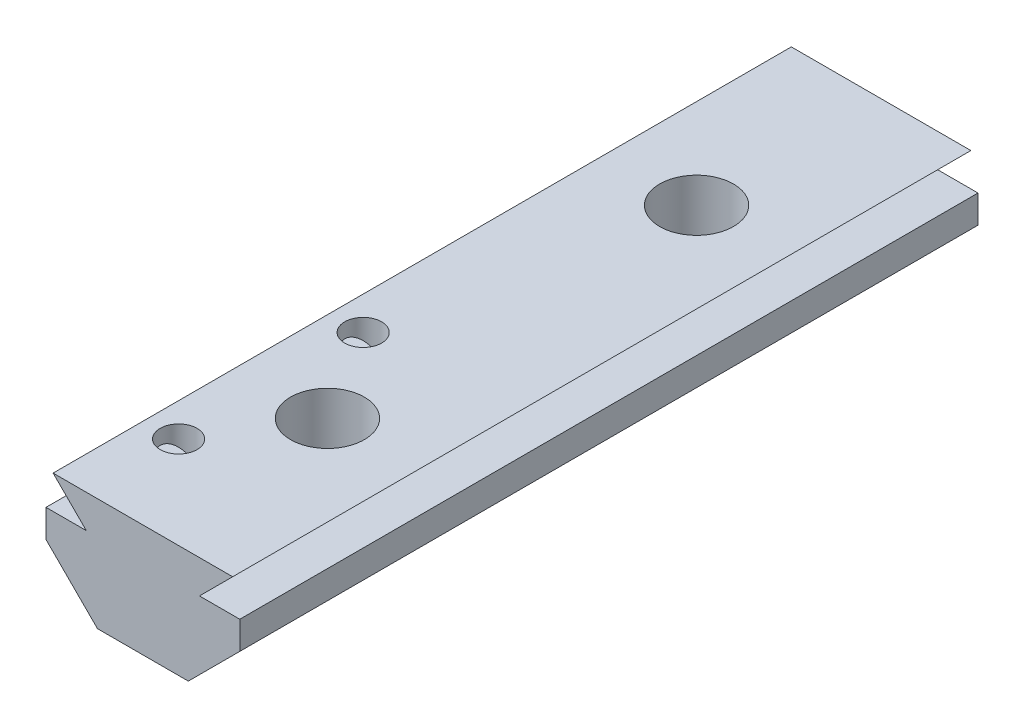
ISO-10303-21;
HEADER;
FILE_DESCRIPTION(('STEP AP214'),'2;1');
FILE_NAME('part.step','',(''),(''),'','','');
FILE_SCHEMA(('AUTOMOTIVE_DESIGN { 1 0 10303 214 1 1 1 1 }'));
ENDSEC;
DATA;
#1=APPLICATION_CONTEXT('core data for automotive mechanical design processes');
#2=APPLICATION_PROTOCOL_DEFINITION('international standard','automotive_design',2000,#1);
#3=PRODUCT_CONTEXT('',#1,'mechanical');
#4=PRODUCT('Part','Part','',(#3));
#5=PRODUCT_RELATED_PRODUCT_CATEGORY('part','',(#4));
#6=PRODUCT_DEFINITION_FORMATION('','',#4);
#7=PRODUCT_DEFINITION_CONTEXT('part definition',#1,'design');
#8=PRODUCT_DEFINITION('design','',#6,#7);
#9=PRODUCT_DEFINITION_SHAPE('','',#8);
#10=(LENGTH_UNIT() NAMED_UNIT(*) SI_UNIT(.MILLI.,.METRE.));
#11=(NAMED_UNIT(*) PLANE_ANGLE_UNIT() SI_UNIT($,.RADIAN.));
#12=(NAMED_UNIT(*) SI_UNIT($,.STERADIAN.) SOLID_ANGLE_UNIT());
#13=UNCERTAINTY_MEASURE_WITH_UNIT(LENGTH_MEASURE(1.E-05),#10,'distance_accuracy_value','');
#14=(GEOMETRIC_REPRESENTATION_CONTEXT(3) GLOBAL_UNCERTAINTY_ASSIGNED_CONTEXT((#13)) GLOBAL_UNIT_ASSIGNED_CONTEXT((#10,
#11,#12)) REPRESENTATION_CONTEXT('',''));
#15=CARTESIAN_POINT('',(0.,0.,0.));
#16=DIRECTION('',(0.,0.,1.));
#17=DIRECTION('',(1.,0.,0.));
#18=AXIS2_PLACEMENT_3D('',#15,#16,#17);
#19=CARTESIAN_POINT('',(2.46065352773283,0.,40.));
#20=DIRECTION('',(-0.707106781186543,0.707106781186552,0.));
#21=DIRECTION('',(-0.707106781186552,-0.707106781186543,0.));
#22=AXIS2_PLACEMENT_3D('',#19,#20,#21);
#23=PLANE('',#22);
#24=DIRECTION('',(0.707106781186552,0.707106781186543,0.));
#25=VECTOR('',#24,1.);
#26=CARTESIAN_POINT('',(2.46065352773283,0.,0.));
#27=LINE('',#26,#25);
#28=CARTESIAN_POINT('',(2.46065352773283,0.,0.));
#29=VERTEX_POINT('',#28);
#30=CARTESIAN_POINT('',(5.25,2.78934647226715,0.));
#31=VERTEX_POINT('',#30);
#32=EDGE_CURVE('E169',#29,#31,#27,.T.);
#33=ORIENTED_EDGE('',*,*,#32,.T.);
#34=DIRECTION('',(0.,0.,-1.));
#35=VECTOR('',#34,1.);
#36=CARTESIAN_POINT('',(5.25,2.78934647226715,40.));
#37=LINE('',#36,#35);
#38=CARTESIAN_POINT('',(5.25,2.78934647226715,40.));
#39=VERTEX_POINT('',#38);
#40=EDGE_CURVE('E127',#39,#31,#37,.T.);
#41=ORIENTED_EDGE('',*,*,#40,.F.);
#42=DIRECTION('',(0.707106781186552,0.707106781186543,0.));
#43=VECTOR('',#42,1.);
#44=CARTESIAN_POINT('',(2.46065352773283,0.,40.));
#45=LINE('',#44,#43);
#46=CARTESIAN_POINT('',(2.46065352773283,0.,40.));
#47=VERTEX_POINT('',#46);
#48=EDGE_CURVE('E200',#47,#39,#45,.T.);
#49=ORIENTED_EDGE('',*,*,#48,.F.);
#50=DIRECTION('',(0.,0.,-1.));
#51=VECTOR('',#50,1.);
#52=CARTESIAN_POINT('',(2.46065352773283,0.,40.));
#53=LINE('',#52,#51);
#54=EDGE_CURVE('E171',#47,#29,#53,.T.);
#55=ORIENTED_EDGE('',*,*,#54,.T.);
#56=EDGE_LOOP('',(#33,#41,#49,#55));
#57=FACE_BOUND('',#56,.T.);
#58=ADVANCED_FACE('F39',(#57),#23,.F.);
#59=CARTESIAN_POINT('',(5.25,2.78934647226715,40.));
#60=DIRECTION('',(-1.,0.,0.));
#61=DIRECTION('',(0.,0.,1.));
#62=AXIS2_PLACEMENT_3D('',#59,#60,#61);
#63=PLANE('',#62);
#64=DIRECTION('',(0.,1.,0.));
#65=VECTOR('',#64,1.);
#66=CARTESIAN_POINT('',(5.25,2.78934647226715,0.));
#67=LINE('',#66,#65);
#68=CARTESIAN_POINT('',(5.25,4.3,0.));
#69=VERTEX_POINT('',#68);
#70=EDGE_CURVE('E162',#31,#69,#67,.T.);
#71=ORIENTED_EDGE('',*,*,#70,.T.);
#72=DIRECTION('',(0.,0.,-1.));
#73=VECTOR('',#72,1.);
#74=CARTESIAN_POINT('',(5.25,4.3,40.));
#75=LINE('',#74,#73);
#76=CARTESIAN_POINT('',(5.25,4.3,40.));
#77=VERTEX_POINT('',#76);
#78=EDGE_CURVE('E153',#77,#69,#75,.T.);
#79=ORIENTED_EDGE('',*,*,#78,.F.);
#80=DIRECTION('',(0.,1.,0.));
#81=VECTOR('',#80,1.);
#82=CARTESIAN_POINT('',(5.25,2.78934647226715,40.));
#83=LINE('',#82,#81);
#84=EDGE_CURVE('E163',#39,#77,#83,.T.);
#85=ORIENTED_EDGE('',*,*,#84,.F.);
#86=ORIENTED_EDGE('',*,*,#40,.T.);
#87=EDGE_LOOP('',(#71,#79,#85,#86));
#88=FACE_BOUND('',#87,.T.);
#89=ADVANCED_FACE('F160',(#88),#63,.F.);
#90=CARTESIAN_POINT('',(5.25,4.3,40.));
#91=DIRECTION('',(0.,-1.,0.));
#92=DIRECTION('',(0.,0.,-1.));
#93=AXIS2_PLACEMENT_3D('',#90,#91,#92);
#94=PLANE('',#93);
#95=DIRECTION('',(-1.,0.,0.));
#96=VECTOR('',#95,1.);
#97=CARTESIAN_POINT('',(5.25,4.3,0.));
#98=LINE('',#97,#96);
#99=CARTESIAN_POINT('',(3.065,4.3,0.));
#100=VERTEX_POINT('',#99);
#101=EDGE_CURVE('E176',#69,#100,#98,.T.);
#102=ORIENTED_EDGE('',*,*,#101,.T.);
#103=DIRECTION('',(0.,0.,-1.));
#104=VECTOR('',#103,1.);
#105=CARTESIAN_POINT('',(3.065,4.3,40.));
#106=LINE('',#105,#104);
#107=CARTESIAN_POINT('',(3.065,4.3,40.));
#108=VERTEX_POINT('',#107);
#109=EDGE_CURVE('E150',#108,#100,#106,.T.);
#110=ORIENTED_EDGE('',*,*,#109,.F.);
#111=DIRECTION('',(-1.,0.,0.));
#112=VECTOR('',#111,1.);
#113=CARTESIAN_POINT('',(5.25,4.3,40.));
#114=LINE('',#113,#112);
#115=EDGE_CURVE('E238',#77,#108,#114,.T.);
#116=ORIENTED_EDGE('',*,*,#115,.F.);
#117=ORIENTED_EDGE('',*,*,#78,.T.);
#118=EDGE_LOOP('',(#102,#110,#116,#117));
#119=FACE_BOUND('',#118,.T.);
#120=ADVANCED_FACE('F290',(#119),#94,.F.);
#121=CARTESIAN_POINT('',(3.065,4.3,40.));
#122=DIRECTION('',(-0.707106781186545,0.70710678118655,0.));
#123=DIRECTION('',(-0.70710678118655,-0.707106781186545,0.));
#124=AXIS2_PLACEMENT_3D('',#121,#122,#123);
#125=PLANE('',#124);
#126=DIRECTION('',(0.70710678118655,0.707106781186545,0.));
#127=VECTOR('',#126,1.);
#128=CARTESIAN_POINT('',(3.065,4.3,0.));
#129=LINE('',#128,#127);
#130=CARTESIAN_POINT('',(4.86500000000002,6.1,0.));
#131=VERTEX_POINT('',#130);
#132=EDGE_CURVE('E186',#100,#131,#129,.T.);
#133=ORIENTED_EDGE('',*,*,#132,.T.);
#134=DIRECTION('',(0.,0.,-1.));
#135=VECTOR('',#134,1.);
#136=CARTESIAN_POINT('',(4.86500000000002,6.1,40.));
#137=LINE('',#136,#135);
#138=CARTESIAN_POINT('',(4.86500000000002,6.1,40.));
#139=VERTEX_POINT('',#138);
#140=EDGE_CURVE('E147',#139,#131,#137,.T.);
#141=ORIENTED_EDGE('',*,*,#140,.F.);
#142=DIRECTION('',(0.70710678118655,0.707106781186545,0.));
#143=VECTOR('',#142,1.);
#144=CARTESIAN_POINT('',(3.065,4.3,40.));
#145=LINE('',#144,#143);
#146=EDGE_CURVE('E236',#108,#139,#145,.T.);
#147=ORIENTED_EDGE('',*,*,#146,.F.);
#148=ORIENTED_EDGE('',*,*,#109,.T.);
#149=EDGE_LOOP('',(#133,#141,#147,#148));
#150=FACE_BOUND('',#149,.T.);
#151=ADVANCED_FACE('F268',(#150),#125,.F.);
#152=CARTESIAN_POINT('',(4.86500000000002,6.1,40.));
#153=DIRECTION('',(0.,-1.,0.));
#154=DIRECTION('',(1.,0.,0.));
#155=AXIS2_PLACEMENT_3D('',#152,#153,#154);
#156=PLANE('',#155);
#157=CARTESIAN_POINT('',(-3.065,6.1,35.));
#158=DIRECTION('',(0.,1.,0.));
#159=DIRECTION('',(-1.,0.,0.));
#160=AXIS2_PLACEMENT_3D('',#157,#158,#159);
#161=CIRCLE('',#160,1.);
#162=CARTESIAN_POINT('',(-4.065,6.1,35.));
#163=VERTEX_POINT('',#162);
#164=EDGE_CURVE('E254',#163,#163,#161,.T.);
#165=ORIENTED_EDGE('',*,*,#164,.F.);
#166=EDGE_LOOP('',(#165));
#167=FACE_BOUND('',#166,.T.);
#168=CARTESIAN_POINT('',(-3.065,6.1,25.));
#169=DIRECTION('',(0.,1.,0.));
#170=DIRECTION('',(-1.,0.,0.));
#171=AXIS2_PLACEMENT_3D('',#168,#169,#170);
#172=CIRCLE('',#171,1.);
#173=CARTESIAN_POINT('',(-4.065,6.1,25.));
#174=VERTEX_POINT('',#173);
#175=EDGE_CURVE('E255',#174,#174,#172,.T.);
#176=ORIENTED_EDGE('',*,*,#175,.F.);
#177=EDGE_LOOP('',(#176));
#178=FACE_BOUND('',#177,.T.);
#179=CARTESIAN_POINT('',(0.,6.1,30.));
#180=DIRECTION('',(0.,1.,0.));
#181=DIRECTION('',(-1.,0.,0.));
#182=AXIS2_PLACEMENT_3D('',#179,#180,#181);
#183=CIRCLE('',#182,2.);
#184=CARTESIAN_POINT('',(-2.,6.1,30.));
#185=VERTEX_POINT('',#184);
#186=EDGE_CURVE('E179',#185,#185,#183,.T.);
#187=ORIENTED_EDGE('',*,*,#186,.F.);
#188=EDGE_LOOP('',(#187));
#189=FACE_BOUND('',#188,.T.);
#190=CARTESIAN_POINT('',(0.,6.1,10.));
#191=DIRECTION('',(0.,1.,0.));
#192=DIRECTION('',(-1.,0.,0.));
#193=AXIS2_PLACEMENT_3D('',#190,#191,#192);
#194=CIRCLE('',#193,2.);
#195=CARTESIAN_POINT('',(-2.,6.1,10.));
#196=VERTEX_POINT('',#195);
#197=EDGE_CURVE('E242',#196,#196,#194,.T.);
#198=ORIENTED_EDGE('',*,*,#197,.F.);
#199=EDGE_LOOP('',(#198));
#200=FACE_BOUND('',#199,.T.);
#201=DIRECTION('',(-1.,0.,0.));
#202=VECTOR('',#201,1.);
#203=CARTESIAN_POINT('',(4.86500000000002,6.1,0.));
#204=LINE('',#203,#202);
#205=CARTESIAN_POINT('',(-4.86500000000002,6.1,0.));
#206=VERTEX_POINT('',#205);
#207=EDGE_CURVE('E188',#131,#206,#204,.T.);
#208=ORIENTED_EDGE('',*,*,#207,.T.);
#209=DIRECTION('',(0.,0.,-1.));
#210=VECTOR('',#209,1.);
#211=CARTESIAN_POINT('',(-4.86500000000002,6.1,40.));
#212=LINE('',#211,#210);
#213=CARTESIAN_POINT('',(-4.86500000000002,6.1,40.));
#214=VERTEX_POINT('',#213);
#215=EDGE_CURVE('E140',#214,#206,#212,.T.);
#216=ORIENTED_EDGE('',*,*,#215,.F.);
#217=DIRECTION('',(-1.,0.,0.));
#218=VECTOR('',#217,1.);
#219=CARTESIAN_POINT('',(4.86500000000002,6.1,40.));
#220=LINE('',#219,#218);
#221=EDGE_CURVE('E234',#139,#214,#220,.T.);
#222=ORIENTED_EDGE('',*,*,#221,.F.);
#223=ORIENTED_EDGE('',*,*,#140,.T.);
#224=EDGE_LOOP('',(#208,#216,#222,#223));
#225=FACE_BOUND('',#224,.T.);
#226=ADVANCED_FACE('F265',(#167,#178,#189,#200,#225),#156,.F.);
#227=CARTESIAN_POINT('',(-3.065,4.3,40.));
#228=DIRECTION('',(0.707106781186544,0.707106781186551,0.));
#229=DIRECTION('',(-0.707106781186551,0.707106781186544,0.));
#230=AXIS2_PLACEMENT_3D('',#227,#228,#229);
#231=PLANE('',#230);
#232=DIRECTION('',(0.,0.,-1.));
#233=VECTOR('',#232,1.);
#234=CARTESIAN_POINT('',(-3.065,4.3,40.));
#235=LINE('',#234,#233);
#236=CARTESIAN_POINT('',(-3.065,4.3,34.));
#237=VERTEX_POINT('',#236);
#238=CARTESIAN_POINT('',(-3.065,4.3,26.));
#239=VERTEX_POINT('',#238);
#240=EDGE_CURVE('E131',#237,#239,#235,.T.);
#241=ORIENTED_EDGE('',*,*,#240,.F.);
#242=CARTESIAN_POINT('',(-3.065,4.3,35.));
#243=DIRECTION('',(0.707106781186544,0.707106781186551,0.));
#244=DIRECTION('',(-0.707106781186551,0.707106781186544,0.));
#245=AXIS2_PLACEMENT_3D('',#242,#243,#244);
#246=ELLIPSE('',#245,1.41421356237309,1.);
#247=CARTESIAN_POINT('',(-3.065,4.3,36.));
#248=VERTEX_POINT('',#247);
#249=EDGE_CURVE('E59',#237,#248,#246,.T.);
#250=ORIENTED_EDGE('',*,*,#249,.T.);
#251=CARTESIAN_POINT('',(-3.065,4.3,40.));
#252=VERTEX_POINT('',#251);
#253=EDGE_CURVE('E138',#252,#248,#235,.T.);
#254=ORIENTED_EDGE('',*,*,#253,.F.);
#255=DIRECTION('',(0.707106781186551,-0.707106781186544,0.));
#256=VECTOR('',#255,1.);
#257=CARTESIAN_POINT('',(-3.065,4.3,40.));
#258=LINE('',#257,#256);
#259=EDGE_CURVE('E232',#214,#252,#258,.T.);
#260=ORIENTED_EDGE('',*,*,#259,.F.);
#261=ORIENTED_EDGE('',*,*,#215,.T.);
#262=DIRECTION('',(0.707106781186551,-0.707106781186544,0.));
#263=VECTOR('',#262,1.);
#264=CARTESIAN_POINT('',(-3.065,4.3,0.));
#265=LINE('',#264,#263);
#266=CARTESIAN_POINT('',(-3.065,4.3,0.));
#267=VERTEX_POINT('',#266);
#268=EDGE_CURVE('E190',#206,#267,#265,.T.);
#269=ORIENTED_EDGE('',*,*,#268,.T.);
#270=CARTESIAN_POINT('',(-3.065,4.3,24.));
#271=VERTEX_POINT('',#270);
#272=EDGE_CURVE('E133',#271,#267,#235,.T.);
#273=ORIENTED_EDGE('',*,*,#272,.F.);
#274=CARTESIAN_POINT('',(-3.065,4.3,25.));
#275=DIRECTION('',(0.707106781186544,0.707106781186551,0.));
#276=DIRECTION('',(-0.707106781186551,0.707106781186544,0.));
#277=AXIS2_PLACEMENT_3D('',#274,#275,#276);
#278=ELLIPSE('',#277,1.41421356237309,1.);
#279=EDGE_CURVE('E52',#271,#239,#278,.T.);
#280=ORIENTED_EDGE('',*,*,#279,.T.);
#281=EDGE_LOOP('',(#241,#250,#254,#260,#261,#269,#273,#280));
#282=FACE_BOUND('',#281,.T.);
#283=ADVANCED_FACE('F130',(#282),#231,.F.);
#284=CARTESIAN_POINT('',(-5.25,4.3,40.));
#285=DIRECTION('',(0.,-1.,0.));
#286=DIRECTION('',(1.,0.,0.));
#287=AXIS2_PLACEMENT_3D('',#284,#285,#286);
#288=PLANE('',#287);
#289=ORIENTED_EDGE('',*,*,#253,.T.);
#290=CARTESIAN_POINT('',(-3.065,4.3,35.));
#291=DIRECTION('',(0.,-1.,0.));
#292=DIRECTION('',(1.,0.,0.));
#293=AXIS2_PLACEMENT_3D('',#290,#291,#292);
#294=CIRCLE('',#293,1.);
#295=EDGE_CURVE('E12',#248,#237,#294,.T.);
#296=ORIENTED_EDGE('',*,*,#295,.T.);
#297=ORIENTED_EDGE('',*,*,#240,.T.);
#298=CARTESIAN_POINT('',(-3.065,4.3,25.));
#299=DIRECTION('',(0.,-1.,0.));
#300=DIRECTION('',(1.,0.,0.));
#301=AXIS2_PLACEMENT_3D('',#298,#299,#300);
#302=CIRCLE('',#301,1.);
#303=EDGE_CURVE('E46',#239,#271,#302,.T.);
#304=ORIENTED_EDGE('',*,*,#303,.T.);
#305=ORIENTED_EDGE('',*,*,#272,.T.);
#306=DIRECTION('',(-1.,0.,0.));
#307=VECTOR('',#306,1.);
#308=CARTESIAN_POINT('',(-5.25,4.3,0.));
#309=LINE('',#308,#307);
#310=CARTESIAN_POINT('',(-5.25,4.3,0.));
#311=VERTEX_POINT('',#310);
#312=EDGE_CURVE('E192',#267,#311,#309,.T.);
#313=ORIENTED_EDGE('',*,*,#312,.T.);
#314=DIRECTION('',(0.,0.,-1.));
#315=VECTOR('',#314,1.);
#316=CARTESIAN_POINT('',(-5.25,4.3,40.));
#317=LINE('',#316,#315);
#318=CARTESIAN_POINT('',(-5.25,4.3,40.));
#319=VERTEX_POINT('',#318);
#320=EDGE_CURVE('E141',#319,#311,#317,.T.);
#321=ORIENTED_EDGE('',*,*,#320,.F.);
#322=DIRECTION('',(-1.,0.,0.));
#323=VECTOR('',#322,1.);
#324=CARTESIAN_POINT('',(-5.25,4.3,40.));
#325=LINE('',#324,#323);
#326=EDGE_CURVE('E228',#252,#319,#325,.T.);
#327=ORIENTED_EDGE('',*,*,#326,.F.);
#328=EDGE_LOOP('',(#289,#296,#297,#304,#305,#313,#321,#327));
#329=FACE_BOUND('',#328,.T.);
#330=ADVANCED_FACE('F137',(#329),#288,.F.);
#331=CARTESIAN_POINT('',(-5.25,2.78934647226715,40.));
#332=DIRECTION('',(1.,0.,0.));
#333=DIRECTION('',(0.,1.,0.));
#334=AXIS2_PLACEMENT_3D('',#331,#332,#333);
#335=PLANE('',#334);
#336=DIRECTION('',(0.,-1.,0.));
#337=VECTOR('',#336,1.);
#338=CARTESIAN_POINT('',(-5.25,2.78934647226715,0.));
#339=LINE('',#338,#337);
#340=CARTESIAN_POINT('',(-5.25,2.78934647226715,0.));
#341=VERTEX_POINT('',#340);
#342=EDGE_CURVE('E194',#311,#341,#339,.T.);
#343=ORIENTED_EDGE('',*,*,#342,.T.);
#344=DIRECTION('',(0.,0.,-1.));
#345=VECTOR('',#344,1.);
#346=CARTESIAN_POINT('',(-5.25,2.78934647226715,40.));
#347=LINE('',#346,#345);
#348=CARTESIAN_POINT('',(-5.25,2.78934647226715,40.));
#349=VERTEX_POINT('',#348);
#350=EDGE_CURVE('E204',#349,#341,#347,.T.);
#351=ORIENTED_EDGE('',*,*,#350,.F.);
#352=DIRECTION('',(0.,-1.,0.));
#353=VECTOR('',#352,1.);
#354=CARTESIAN_POINT('',(-5.25,2.78934647226715,40.));
#355=LINE('',#354,#353);
#356=EDGE_CURVE('E216',#319,#349,#355,.T.);
#357=ORIENTED_EDGE('',*,*,#356,.F.);
#358=ORIENTED_EDGE('',*,*,#320,.T.);
#359=EDGE_LOOP('',(#343,#351,#357,#358));
#360=FACE_BOUND('',#359,.T.);
#361=ADVANCED_FACE('F215',(#360),#335,.F.);
#362=CARTESIAN_POINT('',(-2.46065352773282,0.,40.));
#363=DIRECTION('',(0.707106781186543,0.707106781186552,0.));
#364=DIRECTION('',(-0.707106781186552,0.707106781186543,0.));
#365=AXIS2_PLACEMENT_3D('',#362,#363,#364);
#366=PLANE('',#365);
#367=DIRECTION('',(0.707106781186552,-0.707106781186543,0.));
#368=VECTOR('',#367,1.);
#369=CARTESIAN_POINT('',(-2.46065352773282,0.,0.));
#370=LINE('',#369,#368);
#371=CARTESIAN_POINT('',(-2.46065352773282,0.,0.));
#372=VERTEX_POINT('',#371);
#373=EDGE_CURVE('E196',#341,#372,#370,.T.);
#374=ORIENTED_EDGE('',*,*,#373,.T.);
#375=DIRECTION('',(0.,0.,-1.));
#376=VECTOR('',#375,1.);
#377=CARTESIAN_POINT('',(-2.46065352773282,0.,40.));
#378=LINE('',#377,#376);
#379=CARTESIAN_POINT('',(-2.46065352773282,0.,40.));
#380=VERTEX_POINT('',#379);
#381=EDGE_CURVE('E202',#380,#372,#378,.T.);
#382=ORIENTED_EDGE('',*,*,#381,.F.);
#383=DIRECTION('',(0.707106781186552,-0.707106781186543,0.));
#384=VECTOR('',#383,1.);
#385=CARTESIAN_POINT('',(-2.46065352773282,0.,40.));
#386=LINE('',#385,#384);
#387=EDGE_CURVE('E227',#349,#380,#386,.T.);
#388=ORIENTED_EDGE('',*,*,#387,.F.);
#389=ORIENTED_EDGE('',*,*,#350,.T.);
#390=EDGE_LOOP('',(#374,#382,#388,#389));
#391=FACE_BOUND('',#390,.T.);
#392=ADVANCED_FACE('F222',(#391),#366,.F.);
#393=CARTESIAN_POINT('',(-2.46065352773282,0.,40.));
#394=DIRECTION('',(0.,1.,0.));
#395=DIRECTION('',(-1.,0.,0.));
#396=AXIS2_PLACEMENT_3D('',#393,#394,#395);
#397=PLANE('',#396);
#398=CARTESIAN_POINT('',(0.,0.,30.));
#399=DIRECTION('',(0.,1.,0.));
#400=DIRECTION('',(-1.,0.,0.));
#401=AXIS2_PLACEMENT_3D('',#398,#399,#400);
#402=CIRCLE('',#401,2.);
#403=CARTESIAN_POINT('',(-2.,0.,30.));
#404=VERTEX_POINT('',#403);
#405=EDGE_CURVE('E174',#404,#404,#402,.T.);
#406=ORIENTED_EDGE('',*,*,#405,.T.);
#407=EDGE_LOOP('',(#406));
#408=FACE_BOUND('',#407,.T.);
#409=CARTESIAN_POINT('',(0.,0.,10.));
#410=DIRECTION('',(0.,1.,0.));
#411=DIRECTION('',(-1.,0.,0.));
#412=AXIS2_PLACEMENT_3D('',#409,#410,#411);
#413=CIRCLE('',#412,2.);
#414=CARTESIAN_POINT('',(-2.,0.,10.));
#415=VERTEX_POINT('',#414);
#416=EDGE_CURVE('E245',#415,#415,#413,.T.);
#417=ORIENTED_EDGE('',*,*,#416,.T.);
#418=EDGE_LOOP('',(#417));
#419=FACE_BOUND('',#418,.T.);
#420=DIRECTION('',(1.,0.,0.));
#421=VECTOR('',#420,1.);
#422=CARTESIAN_POINT('',(-2.46065352773282,0.,0.));
#423=LINE('',#422,#421);
#424=EDGE_CURVE('E198',#372,#29,#423,.T.);
#425=ORIENTED_EDGE('',*,*,#424,.T.);
#426=ORIENTED_EDGE('',*,*,#54,.F.);
#427=DIRECTION('',(1.,0.,0.));
#428=VECTOR('',#427,1.);
#429=CARTESIAN_POINT('',(-2.46065352773282,0.,40.));
#430=LINE('',#429,#428);
#431=EDGE_CURVE('E182',#380,#47,#430,.T.);
#432=ORIENTED_EDGE('',*,*,#431,.F.);
#433=ORIENTED_EDGE('',*,*,#381,.T.);
#434=EDGE_LOOP('',(#425,#426,#432,#433));
#435=FACE_BOUND('',#434,.T.);
#436=ADVANCED_FACE('F225',(#408,#419,#435),#397,.F.);
#437=CARTESIAN_POINT('',(0.,0.,40.));
#438=DIRECTION('',(0.,0.,1.));
#439=DIRECTION('',(1.,0.,0.));
#440=AXIS2_PLACEMENT_3D('',#437,#438,#439);
#441=PLANE('',#440);
#442=ORIENTED_EDGE('',*,*,#48,.T.);
#443=ORIENTED_EDGE('',*,*,#84,.T.);
#444=ORIENTED_EDGE('',*,*,#115,.T.);
#445=ORIENTED_EDGE('',*,*,#146,.T.);
#446=ORIENTED_EDGE('',*,*,#221,.T.);
#447=ORIENTED_EDGE('',*,*,#259,.T.);
#448=ORIENTED_EDGE('',*,*,#326,.T.);
#449=ORIENTED_EDGE('',*,*,#356,.T.);
#450=ORIENTED_EDGE('',*,*,#387,.T.);
#451=ORIENTED_EDGE('',*,*,#431,.T.);
#452=EDGE_LOOP('',(#442,#443,#444,#445,#446,#447,#448,#449,#450,#451));
#453=FACE_BOUND('',#452,.T.);
#454=ADVANCED_FACE('F283',(#453),#441,.T.);
#455=CARTESIAN_POINT('',(0.,0.,0.));
#456=DIRECTION('',(0.,0.,1.));
#457=DIRECTION('',(1.,0.,0.));
#458=AXIS2_PLACEMENT_3D('',#455,#456,#457);
#459=PLANE('',#458);
#460=ORIENTED_EDGE('',*,*,#32,.F.);
#461=ORIENTED_EDGE('',*,*,#424,.F.);
#462=ORIENTED_EDGE('',*,*,#373,.F.);
#463=ORIENTED_EDGE('',*,*,#342,.F.);
#464=ORIENTED_EDGE('',*,*,#312,.F.);
#465=ORIENTED_EDGE('',*,*,#268,.F.);
#466=ORIENTED_EDGE('',*,*,#207,.F.);
#467=ORIENTED_EDGE('',*,*,#132,.F.);
#468=ORIENTED_EDGE('',*,*,#101,.F.);
#469=ORIENTED_EDGE('',*,*,#70,.F.);
#470=EDGE_LOOP('',(#460,#461,#462,#463,#464,#465,#466,#467,#468,#469));
#471=FACE_BOUND('',#470,.T.);
#472=ADVANCED_FACE('F219',(#471),#459,.F.);
#473=CARTESIAN_POINT('',(0.,0.,10.));
#474=DIRECTION('',(0.,1.,0.));
#475=DIRECTION('',(-1.,0.,0.));
#476=AXIS2_PLACEMENT_3D('',#473,#474,#475);
#477=CYLINDRICAL_SURFACE('',#476,2.);
#478=ORIENTED_EDGE('',*,*,#416,.F.);
#479=EDGE_LOOP('',(#478));
#480=FACE_BOUND('',#479,.T.);
#481=ORIENTED_EDGE('',*,*,#197,.T.);
#482=EDGE_LOOP('',(#481));
#483=FACE_BOUND('',#482,.T.);
#484=ADVANCED_FACE('F353',(#480,#483),#477,.F.);
#485=CARTESIAN_POINT('',(0.,0.,30.));
#486=DIRECTION('',(0.,1.,0.));
#487=DIRECTION('',(-1.,0.,0.));
#488=AXIS2_PLACEMENT_3D('',#485,#486,#487);
#489=CYLINDRICAL_SURFACE('',#488,2.);
#490=ORIENTED_EDGE('',*,*,#405,.F.);
#491=EDGE_LOOP('',(#490));
#492=FACE_BOUND('',#491,.T.);
#493=ORIENTED_EDGE('',*,*,#186,.T.);
#494=EDGE_LOOP('',(#493));
#495=FACE_BOUND('',#494,.T.);
#496=ADVANCED_FACE('F369',(#492,#495),#489,.F.);
#497=CARTESIAN_POINT('',(-3.06499999999999,-2.82842712474619,25.));
#498=DIRECTION('',(0.,1.,0.));
#499=DIRECTION('',(-1.,0.,0.));
#500=AXIS2_PLACEMENT_3D('',#497,#498,#499);
#501=CYLINDRICAL_SURFACE('',#500,1.);
#502=CARTESIAN_POINT('',(-3.065,2.,25.));
#503=DIRECTION('',(0.,1.,0.));
#504=DIRECTION('',(-1.,0.,0.));
#505=AXIS2_PLACEMENT_3D('',#502,#503,#504);
#506=CIRCLE('',#505,1.);
#507=CARTESIAN_POINT('',(-4.065,2.,25.));
#508=VERTEX_POINT('',#507);
#509=EDGE_CURVE('E251',#508,#508,#506,.F.);
#510=ORIENTED_EDGE('',*,*,#509,.T.);
#511=EDGE_LOOP('',(#510));
#512=FACE_BOUND('',#511,.T.);
#513=ORIENTED_EDGE('',*,*,#175,.T.);
#514=EDGE_LOOP('',(#513));
#515=FACE_BOUND('',#514,.T.);
#516=ORIENTED_EDGE('',*,*,#303,.F.);
#517=ORIENTED_EDGE('',*,*,#279,.F.);
#518=EDGE_LOOP('',(#516,#517));
#519=FACE_BOUND('',#518,.T.);
#520=ADVANCED_FACE('F123',(#512,#515,#519),#501,.F.);
#521=CARTESIAN_POINT('',(-2.46065352773282,2.,40.));
#522=DIRECTION('',(0.,1.,0.));
#523=DIRECTION('',(-1.,0.,0.));
#524=AXIS2_PLACEMENT_3D('',#521,#522,#523);
#525=PLANE('',#524);
#526=ORIENTED_EDGE('',*,*,#509,.F.);
#527=EDGE_LOOP('',(#526));
#528=FACE_BOUND('',#527,.T.);
#529=ADVANCED_FACE('F407',(#528),#525,.T.);
#530=CARTESIAN_POINT('',(-3.06499999999999,-2.82842712474619,35.));
#531=DIRECTION('',(0.,1.,0.));
#532=DIRECTION('',(-1.,0.,0.));
#533=AXIS2_PLACEMENT_3D('',#530,#531,#532);
#534=CYLINDRICAL_SURFACE('',#533,1.);
#535=CARTESIAN_POINT('',(-3.065,2.,35.));
#536=DIRECTION('',(0.,1.,0.));
#537=DIRECTION('',(-1.,0.,0.));
#538=AXIS2_PLACEMENT_3D('',#535,#536,#537);
#539=CIRCLE('',#538,1.);
#540=CARTESIAN_POINT('',(-4.065,2.,35.));
#541=VERTEX_POINT('',#540);
#542=EDGE_CURVE('E134',#541,#541,#539,.F.);
#543=ORIENTED_EDGE('',*,*,#542,.T.);
#544=EDGE_LOOP('',(#543));
#545=FACE_BOUND('',#544,.T.);
#546=ORIENTED_EDGE('',*,*,#164,.T.);
#547=EDGE_LOOP('',(#546));
#548=FACE_BOUND('',#547,.T.);
#549=ORIENTED_EDGE('',*,*,#295,.F.);
#550=ORIENTED_EDGE('',*,*,#249,.F.);
#551=EDGE_LOOP('',(#549,#550));
#552=FACE_BOUND('',#551,.T.);
#553=ADVANCED_FACE('F263',(#545,#548,#552),#534,.F.);
#554=CARTESIAN_POINT('',(-2.46065352773282,2.,40.));
#555=DIRECTION('',(0.,1.,0.));
#556=DIRECTION('',(-1.,0.,0.));
#557=AXIS2_PLACEMENT_3D('',#554,#555,#556);
#558=PLANE('',#557);
#559=ORIENTED_EDGE('',*,*,#542,.F.);
#560=EDGE_LOOP('',(#559));
#561=FACE_BOUND('',#560,.T.);
#562=ADVANCED_FACE('F426',(#561),#558,.T.);
#563=CLOSED_SHELL('',(#58,#89,#120,#151,#226,#283,#330,#361,#392,#436,#454,#472,#484,#496,#520,
#529,#553,#562));
#564=MANIFOLD_SOLID_BREP('B2',#563);
#565=ADVANCED_BREP_SHAPE_REPRESENTATION('',(#18,#564),#14);
#566=SHAPE_DEFINITION_REPRESENTATION(#9,#565);
ENDSEC;
END-ISO-10303-21;
